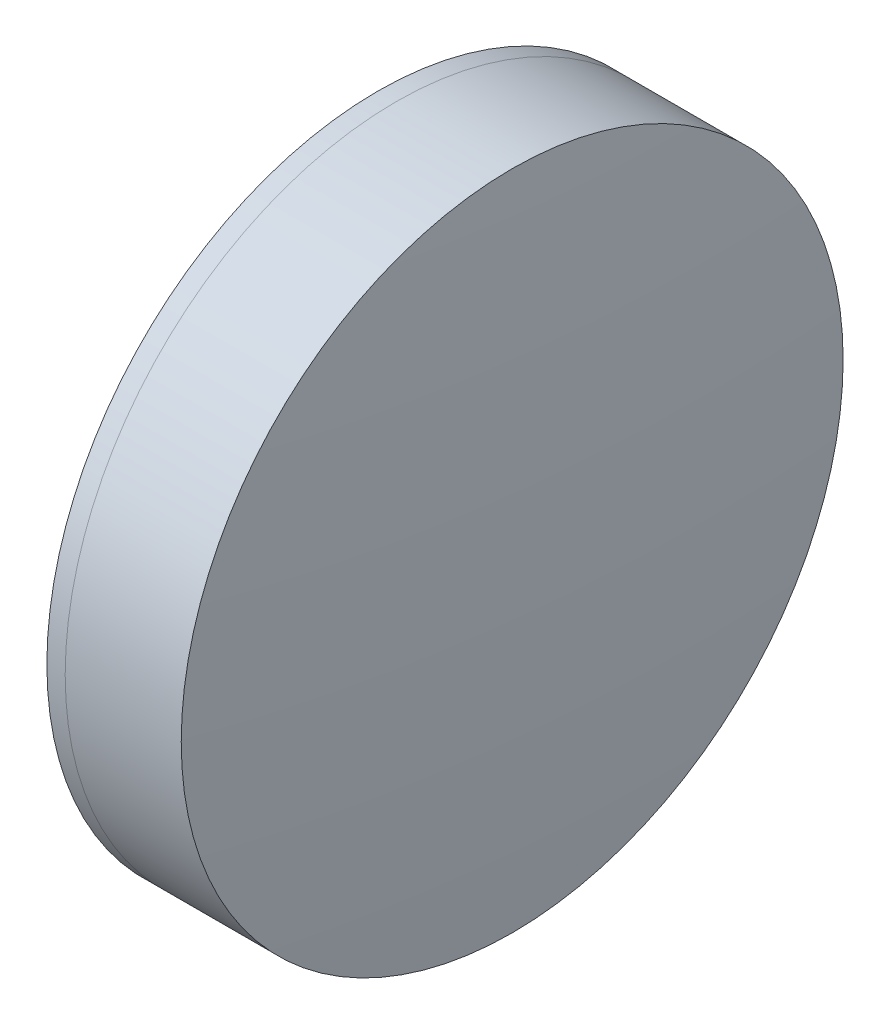
ISO-10303-21;
HEADER;
FILE_DESCRIPTION(('STEP AP214'),'2;1');
FILE_NAME('part.step','',(''),(''),'','','');
FILE_SCHEMA(('AUTOMOTIVE_DESIGN { 1 0 10303 214 1 1 1 1 }'));
ENDSEC;
DATA;
#1=APPLICATION_CONTEXT('core data for automotive mechanical design processes');
#2=APPLICATION_PROTOCOL_DEFINITION('international standard','automotive_design',2000,#1);
#3=PRODUCT_CONTEXT('',#1,'mechanical');
#4=PRODUCT('Part','Part','',(#3));
#5=PRODUCT_RELATED_PRODUCT_CATEGORY('part','',(#4));
#6=PRODUCT_DEFINITION_FORMATION('','',#4);
#7=PRODUCT_DEFINITION_CONTEXT('part definition',#1,'design');
#8=PRODUCT_DEFINITION('design','',#6,#7);
#9=PRODUCT_DEFINITION_SHAPE('','',#8);
#10=(LENGTH_UNIT() NAMED_UNIT(*) SI_UNIT(.MILLI.,.METRE.));
#11=(NAMED_UNIT(*) PLANE_ANGLE_UNIT() SI_UNIT($,.RADIAN.));
#12=(NAMED_UNIT(*) SI_UNIT($,.STERADIAN.) SOLID_ANGLE_UNIT());
#13=UNCERTAINTY_MEASURE_WITH_UNIT(LENGTH_MEASURE(1.E-05),#10,'distance_accuracy_value','');
#14=(GEOMETRIC_REPRESENTATION_CONTEXT(3) GLOBAL_UNCERTAINTY_ASSIGNED_CONTEXT((#13)) GLOBAL_UNIT_ASSIGNED_CONTEXT((#10,
#11,#12)) REPRESENTATION_CONTEXT('',''));
#15=CARTESIAN_POINT('',(0.,0.,0.));
#16=DIRECTION('',(0.,0.,1.));
#17=DIRECTION('',(1.,0.,0.));
#18=AXIS2_PLACEMENT_3D('',#15,#16,#17);
#19=CARTESIAN_POINT('',(486.158436508957,0.,0.));
#20=DIRECTION('',(-1.,0.,0.));
#21=DIRECTION('',(0.,0.,1.));
#22=AXIS2_PLACEMENT_3D('',#19,#20,#21);
#23=SPHERICAL_SURFACE('',#22,44.6000000000001);
#24=CARTESIAN_POINT('',(522.819042068603,0.,0.));
#25=DIRECTION('',(-1.,0.,0.));
#26=DIRECTION('',(0.,0.,1.));
#27=AXIS2_PLACEMENT_3D('',#24,#25,#26);
#28=CIRCLE('',#27,25.4);
#29=CARTESIAN_POINT('',(522.819042068603,0.,25.4));
#30=VERTEX_POINT('',#29);
#31=EDGE_CURVE('E11',#30,#30,#28,.T.);
#32=ORIENTED_EDGE('',*,*,#31,.T.);
#33=EDGE_LOOP('',(#32));
#34=FACE_BOUND('',#33,.T.);
#35=ADVANCED_FACE('F45',(#34),#23,.F.);
#36=CARTESIAN_POINT('',(-0.551919992657797,0.,0.));
#37=DIRECTION('',(-1.,0.,0.));
#38=DIRECTION('',(0.,0.,1.));
#39=AXIS2_PLACEMENT_3D('',#36,#37,#38);
#40=CYLINDRICAL_SURFACE('',#39,25.4);
#41=CARTESIAN_POINT('',(531.724801831018,0.,0.));
#42=DIRECTION('',(-1.,0.,0.));
#43=DIRECTION('',(0.,0.,1.));
#44=AXIS2_PLACEMENT_3D('',#41,#42,#43);
#45=CIRCLE('',#44,25.4);
#46=CARTESIAN_POINT('',(531.724801831018,0.,25.4));
#47=VERTEX_POINT('',#46);
#48=EDGE_CURVE('E51',#47,#47,#45,.T.);
#49=ORIENTED_EDGE('',*,*,#48,.T.);
#50=EDGE_LOOP('',(#49));
#51=FACE_BOUND('',#50,.T.);
#52=ORIENTED_EDGE('',*,*,#31,.F.);
#53=EDGE_LOOP('',(#52));
#54=FACE_BOUND('',#53,.T.);
#55=ADVANCED_FACE('F57',(#51,#54),#40,.T.);
#56=CARTESIAN_POINT('',(220.158436508957,0.,0.));
#57=DIRECTION('',(-1.,0.,0.));
#58=DIRECTION('',(0.,0.,1.));
#59=AXIS2_PLACEMENT_3D('',#56,#57,#58);
#60=SPHERICAL_SURFACE('',#59,312.6);
#61=ORIENTED_EDGE('',*,*,#48,.F.);
#62=EDGE_LOOP('',(#61));
#63=FACE_BOUND('',#62,.T.);
#64=ADVANCED_FACE('F60',(#63),#60,.T.);
#65=CLOSED_SHELL('',(#35,#55,#64));
#66=MANIFOLD_SOLID_BREP('B2',#65);
#67=CARTESIAN_POINT('',(566.558436508957,0.,0.));
#68=DIRECTION('',(-1.,0.,0.));
#69=DIRECTION('',(0.,0.,1.));
#70=AXIS2_PLACEMENT_3D('',#67,#68,#69);
#71=SPHERICAL_SURFACE('',#70,51.8);
#72=CARTESIAN_POINT('',(521.413337107139,0.,0.));
#73=DIRECTION('',(-1.,0.,0.));
#74=DIRECTION('',(0.,0.,1.));
#75=AXIS2_PLACEMENT_3D('',#72,#73,#74);
#76=CIRCLE('',#75,25.4);
#77=CARTESIAN_POINT('',(521.413337107139,0.,25.4));
#78=VERTEX_POINT('',#77);
#79=EDGE_CURVE('E44',#78,#78,#76,.T.);
#80=ORIENTED_EDGE('',*,*,#79,.T.);
#81=EDGE_LOOP('',(#80));
#82=FACE_BOUND('',#81,.T.);
#83=ADVANCED_FACE('F86',(#82),#71,.T.);
#84=CARTESIAN_POINT('',(124.523309526045,0.,0.));
#85=DIRECTION('',(-1.,0.,0.));
#86=DIRECTION('',(0.,0.,1.));
#87=AXIS2_PLACEMENT_3D('',#84,#85,#86);
#88=CYLINDRICAL_SURFACE('',#87,25.4);
#89=CARTESIAN_POINT('',(522.819042068603,0.,0.));
#90=DIRECTION('',(-1.,0.,0.));
#91=DIRECTION('',(0.,0.,1.));
#92=AXIS2_PLACEMENT_3D('',#89,#90,#91);
#93=CIRCLE('',#92,25.4);
#94=CARTESIAN_POINT('',(522.819042068603,0.,25.4));
#95=VERTEX_POINT('',#94);
#96=EDGE_CURVE('E92',#95,#95,#93,.T.);
#97=ORIENTED_EDGE('',*,*,#96,.T.);
#98=EDGE_LOOP('',(#97));
#99=FACE_BOUND('',#98,.T.);
#100=ORIENTED_EDGE('',*,*,#79,.F.);
#101=EDGE_LOOP('',(#100));
#102=FACE_BOUND('',#101,.T.);
#103=ADVANCED_FACE('F98',(#99,#102),#88,.T.);
#104=CARTESIAN_POINT('',(486.158436508957,0.,0.));
#105=DIRECTION('',(-1.,0.,0.));
#106=DIRECTION('',(0.,0.,1.));
#107=AXIS2_PLACEMENT_3D('',#104,#105,#106);
#108=SPHERICAL_SURFACE('',#107,44.6000000000001);
#109=ORIENTED_EDGE('',*,*,#96,.F.);
#110=EDGE_LOOP('',(#109));
#111=FACE_BOUND('',#110,.T.);
#112=ADVANCED_FACE('F101',(#111),#108,.T.);
#113=CLOSED_SHELL('',(#83,#103,#112));
#114=MANIFOLD_SOLID_BREP('B6',#113);
#115=ADVANCED_BREP_SHAPE_REPRESENTATION('',(#18,#66,#114),#14);
#116=SHAPE_DEFINITION_REPRESENTATION(#9,#115);
ENDSEC;
END-ISO-10303-21;
